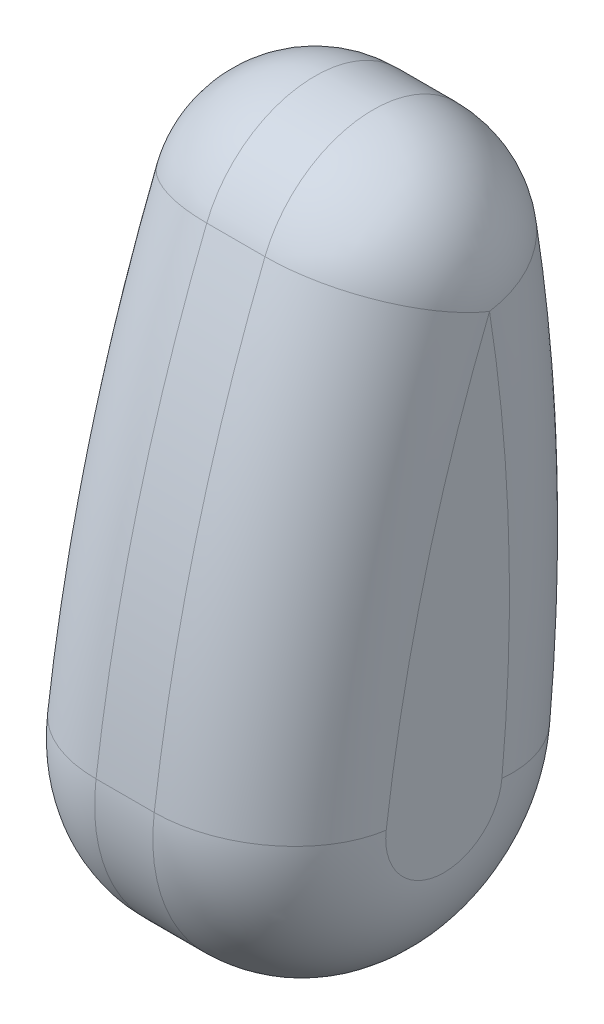
ISO-10303-21;
HEADER;
FILE_DESCRIPTION(('STEP AP214'),'2;1');
FILE_NAME('part.step','',(''),(''),'','','');
FILE_SCHEMA(('AUTOMOTIVE_DESIGN { 1 0 10303 214 1 1 1 1 }'));
ENDSEC;
DATA;
#1=APPLICATION_CONTEXT('core data for automotive mechanical design processes');
#2=APPLICATION_PROTOCOL_DEFINITION('international standard','automotive_design',2000,#1);
#3=PRODUCT_CONTEXT('',#1,'mechanical');
#4=PRODUCT('Part','Part','',(#3));
#5=PRODUCT_RELATED_PRODUCT_CATEGORY('part','',(#4));
#6=PRODUCT_DEFINITION_FORMATION('','',#4);
#7=PRODUCT_DEFINITION_CONTEXT('part definition',#1,'design');
#8=PRODUCT_DEFINITION('design','',#6,#7);
#9=PRODUCT_DEFINITION_SHAPE('','',#8);
#10=(LENGTH_UNIT() NAMED_UNIT(*) SI_UNIT(.MILLI.,.METRE.));
#11=(NAMED_UNIT(*) PLANE_ANGLE_UNIT() SI_UNIT($,.RADIAN.));
#12=(NAMED_UNIT(*) SI_UNIT($,.STERADIAN.) SOLID_ANGLE_UNIT());
#13=UNCERTAINTY_MEASURE_WITH_UNIT(LENGTH_MEASURE(1.E-05),#10,'distance_accuracy_value','');
#14=(GEOMETRIC_REPRESENTATION_CONTEXT(3) GLOBAL_UNCERTAINTY_ASSIGNED_CONTEXT((#13)) GLOBAL_UNIT_ASSIGNED_CONTEXT((#10,
#11,#12)) REPRESENTATION_CONTEXT('',''));
#15=CARTESIAN_POINT('',(0.,0.,0.));
#16=DIRECTION('',(0.,0.,1.));
#17=DIRECTION('',(1.,0.,0.));
#18=AXIS2_PLACEMENT_3D('',#15,#16,#17);
#19=CARTESIAN_POINT('',(-12.7000000000001,258.624713958398,676.690201839394));
#20=DIRECTION('',(-1.,0.,0.));
#21=DIRECTION('',(0.,0.,1.));
#22=AXIS2_PLACEMENT_3D('',#19,#20,#21);
#23=TOROIDAL_SURFACE('',#22,711.2,50.8);
#24=CARTESIAN_POINT('',(-12.6999999999948,190.320624404613,-31.222216013433));
#25=DIRECTION('',(1.70149166636778E-13,0.995377415428558,-0.0960406208578616));
#26=DIRECTION('',(0.,-0.0960406208578616,-0.995377415428558));
#27=AXIS2_PLACEMENT_3D('',#24,#25,#26);
#28=CIRCLE('',#27,50.7999999999998);
#29=CARTESIAN_POINT('',(-63.4999999999979,190.320624404621,-31.2222160134343));
#30=VERTEX_POINT('',#29);
#31=CARTESIAN_POINT('',(-12.7,185.441760865058,-81.7873887172027));
#32=VERTEX_POINT('',#31);
#33=EDGE_CURVE('E82',#30,#32,#28,.F.);
#34=ORIENTED_EDGE('',*,*,#33,.F.);
#35=CARTESIAN_POINT('',(-63.5,258.624713958398,676.690201839394));
#36=DIRECTION('',(-1.,0.,0.));
#37=DIRECTION('',(0.,0.,1.));
#38=AXIS2_PLACEMENT_3D('',#35,#36,#37);
#39=CIRCLE('',#38,711.2);
#40=CARTESIAN_POINT('',(-63.5,369.444816208991,-25.8226770013918));
#41=VERTEX_POINT('',#40);
#42=EDGE_CURVE('E86',#41,#30,#39,.T.);
#43=ORIENTED_EDGE('',*,*,#42,.F.);
#44=CARTESIAN_POINT('',(-12.7,369.444816208991,-25.8226770013919));
#45=DIRECTION('',(0.,0.987785262712015,0.155821291128508));
#46=DIRECTION('',(0.,-0.155821291128508,0.987785262712015));
#47=AXIS2_PLACEMENT_3D('',#44,#45,#46);
#48=CIRCLE('',#47,50.8);
#49=CARTESIAN_POINT('',(-12.7,377.36053779832,-76.0021683471621));
#50=VERTEX_POINT('',#49);
#51=EDGE_CURVE('E106',#50,#41,#48,.T.);
#52=ORIENTED_EDGE('',*,*,#51,.F.);
#53=CARTESIAN_POINT('',(-12.7,258.624713958398,676.690201839394));
#54=DIRECTION('',(-1.,0.,0.));
#55=DIRECTION('',(0.,0.,1.));
#56=AXIS2_PLACEMENT_3D('',#53,#54,#55);
#57=CIRCLE('',#56,762.);
#58=EDGE_CURVE('E89',#32,#50,#57,.F.);
#59=ORIENTED_EDGE('',*,*,#58,.F.);
#60=EDGE_LOOP('',(#34,#43,#52,#59));
#61=FACE_BOUND('',#60,.T.);
#62=ADVANCED_FACE('F16',(#61),#23,.T.);
#63=CARTESIAN_POINT('',(63.5,258.624713958398,676.690201839394));
#64=DIRECTION('',(-1.,0.,0.));
#65=DIRECTION('',(0.,0.,1.));
#66=AXIS2_PLACEMENT_3D('',#63,#64,#65);
#67=CYLINDRICAL_SURFACE('',#66,762.);
#68=DIRECTION('',(-1.,0.,0.));
#69=VECTOR('',#68,1.);
#70=CARTESIAN_POINT('',(63.5,377.36053779832,-76.0021683471621));
#71=LINE('',#70,#69);
#72=CARTESIAN_POINT('',(12.7,377.36053779832,-76.0021683471621));
#73=VERTEX_POINT('',#72);
#74=EDGE_CURVE('E183',#73,#50,#71,.T.);
#75=ORIENTED_EDGE('',*,*,#74,.F.);
#76=CARTESIAN_POINT('',(12.6999999999997,258.624713958398,676.690201839393));
#77=DIRECTION('',(1.,0.,0.));
#78=DIRECTION('',(0.,0.,-1.));
#79=AXIS2_PLACEMENT_3D('',#76,#77,#78);
#80=CIRCLE('',#79,761.999999999999);
#81=CARTESIAN_POINT('',(12.7000000000038,185.441760865066,-81.7873887172034));
#82=VERTEX_POINT('',#81);
#83=EDGE_CURVE('E193',#82,#73,#80,.T.);
#84=ORIENTED_EDGE('',*,*,#83,.F.);
#85=DIRECTION('',(-1.,0.,0.));
#86=VECTOR('',#85,1.);
#87=CARTESIAN_POINT('',(63.5,185.441760865066,-81.7873887172023));
#88=LINE('',#87,#86);
#89=EDGE_CURVE('E199',#32,#82,#88,.F.);
#90=ORIENTED_EDGE('',*,*,#89,.F.);
#91=ORIENTED_EDGE('',*,*,#58,.T.);
#92=EDGE_LOOP('',(#75,#84,#90,#91));
#93=FACE_BOUND('',#92,.T.);
#94=ADVANCED_FACE('F272',(#93),#67,.T.);
#95=CARTESIAN_POINT('',(-12.6999999999999,369.444816208991,-25.8226770013918));
#96=DIRECTION('',(1.,0.,0.));
#97=DIRECTION('',(0.,1.,0.));
#98=AXIS2_PLACEMENT_3D('',#95,#96,#97);
#99=SPHERICAL_SURFACE('',#98,50.8000000000001);
#100=CARTESIAN_POINT('',(-12.7,369.444816208991,-25.8226770013918));
#101=DIRECTION('',(-1.,0.,0.));
#102=DIRECTION('',(0.,0.,1.));
#103=AXIS2_PLACEMENT_3D('',#100,#101,#102);
#104=CIRCLE('',#103,50.7999999999999);
#105=CARTESIAN_POINT('',(-12.7,388.315122380009,21.3424748059754));
#106=VERTEX_POINT('',#105);
#107=EDGE_CURVE('E175',#50,#106,#104,.F.);
#108=ORIENTED_EDGE('',*,*,#107,.F.);
#109=ORIENTED_EDGE('',*,*,#51,.T.);
#110=CARTESIAN_POINT('',(-12.7,369.444816208991,-25.822677001392));
#111=DIRECTION('',(0.,-0.928447870223772,0.371462719901934));
#112=DIRECTION('',(0.,-0.371462719901934,-0.928447870223772));
#113=AXIS2_PLACEMENT_3D('',#110,#111,#112);
#114=CIRCLE('',#113,50.8);
#115=EDGE_CURVE('E173',#106,#41,#114,.T.);
#116=ORIENTED_EDGE('',*,*,#115,.F.);
#117=EDGE_LOOP('',(#108,#109,#116));
#118=FACE_BOUND('',#117,.T.);
#119=ADVANCED_FACE('F245',(#118),#99,.T.);
#120=CARTESIAN_POINT('',(-63.5,157.286657085043,-37.1547824372344));
#121=DIRECTION('',(-1.,0.,0.));
#122=DIRECTION('',(0.,0.,1.));
#123=AXIS2_PLACEMENT_3D('',#120,#121,#122);
#124=PLANE('',#123);
#125=CARTESIAN_POINT('',(-63.4999999999956,192.760056174411,-5.93962966154688));
#126=DIRECTION('',(1.,-1.65709346215678E-13,0.));
#127=DIRECTION('',(0.,0.127587527499766,0.991827315023385));
#128=AXIS2_PLACEMENT_3D('',#125,#126,#127);
#129=CIRCLE('',#128,25.4000000000026);
#130=CARTESIAN_POINT('',(-63.4999999999993,196.000779372906,19.2527841400497));
#131=VERTEX_POINT('',#130);
#132=CARTESIAN_POINT('',(-63.4999999999999,167.360056174403,-5.9396296615455));
#133=VERTEX_POINT('',#132);
#134=EDGE_CURVE('E97',#131,#133,#129,.T.);
#135=ORIENTED_EDGE('',*,*,#134,.F.);
#136=CARTESIAN_POINT('',(-63.5,105.260529814736,-686.134802304539));
#137=DIRECTION('',(-1.,0.,0.));
#138=DIRECTION('',(0.,0.,1.));
#139=AXIS2_PLACEMENT_3D('',#136,#137,#138);
#140=CIRCLE('',#139,711.2);
#141=EDGE_CURVE('E104',#41,#131,#140,.F.);
#142=ORIENTED_EDGE('',*,*,#141,.F.);
#143=ORIENTED_EDGE('',*,*,#42,.T.);
#144=CARTESIAN_POINT('',(-63.4999999999956,192.760056174411,-5.93962966154688));
#145=DIRECTION('',(1.,-1.65709346215678E-13,0.));
#146=DIRECTION('',(-1.66096358014711E-13,-1.,0.));
#147=AXIS2_PLACEMENT_3D('',#144,#145,#146);
#148=CIRCLE('',#147,25.4000000000116);
#149=EDGE_CURVE('E94',#30,#133,#148,.F.);
#150=ORIENTED_EDGE('',*,*,#149,.T.);
#151=EDGE_LOOP('',(#135,#142,#143,#150));
#152=FACE_BOUND('',#151,.T.);
#153=ADVANCED_FACE('F102',(#152),#124,.T.);
#154=CARTESIAN_POINT('',(-12.6999999999916,218.160056174406,-5.93962966154413));
#155=DIRECTION('',(0.,0.,1.));
#156=DIRECTION('',(1.65720728915659E-13,1.,0.));
#157=AXIS2_PLACEMENT_3D('',#154,#155,#156);
#158=CIRCLE('',#157,50.7999999999998);
#159=TRIMMED_CURVE('',#158,(PARAMETER_VALUE(-2.09439510239328)),
(PARAMETER_VALUE(2.09439510239328)),.T.,.PARAMETER.);
#160=CARTESIAN_POINT('',(-12.6999999999958,192.760056174403,-5.93962966154413));
#161=DIRECTION('',(1.,-1.65709346215678E-13,0.));
#162=AXIS1_PLACEMENT('',#160,#161);
#163=SURFACE_OF_REVOLUTION('',#159,#162);
#164=CARTESIAN_POINT('',(-12.7,192.760056174399,-5.93962966154271));
#165=DIRECTION('',(-1.,0.,0.));
#166=DIRECTION('',(0.,0.,1.));
#167=AXIS2_PLACEMENT_3D('',#164,#165,#166);
#168=CIRCLE('',#167,76.2);
#169=CARTESIAN_POINT('',(-12.7,202.482225769918,69.6376117432342));
#170=VERTEX_POINT('',#169);
#171=EDGE_CURVE('E149',#170,#32,#168,.F.);
#172=ORIENTED_EDGE('',*,*,#171,.F.);
#173=CARTESIAN_POINT('',(-12.7,196.000779372906,19.2527841400497));
#174=DIRECTION('',(0.,0.991827315023324,-0.127587527500238));
#175=DIRECTION('',(0.,0.127587527500238,0.991827315023324));
#176=AXIS2_PLACEMENT_3D('',#173,#174,#175);
#177=CIRCLE('',#176,50.8);
#178=EDGE_CURVE('E162',#131,#170,#177,.T.);
#179=ORIENTED_EDGE('',*,*,#178,.F.);
#180=ORIENTED_EDGE('',*,*,#134,.T.);
#181=ORIENTED_EDGE('',*,*,#149,.F.);
#182=ORIENTED_EDGE('',*,*,#33,.T.);
#183=EDGE_LOOP('',(#172,#179,#180,#181,#182));
#184=FACE_BOUND('',#183,.T.);
#185=ADVANCED_FACE('F95',(#184),#163,.F.);
#186=CARTESIAN_POINT('',(12.6999999999997,258.624713958398,676.690201839393));
#187=DIRECTION('',(-1.,0.,0.));
#188=DIRECTION('',(0.,0.,1.));
#189=AXIS2_PLACEMENT_3D('',#186,#187,#188);
#190=TOROIDAL_SURFACE('',#189,711.199999999999,50.8);
#191=CARTESIAN_POINT('',(12.7,369.444816208991,-25.8226770013918));
#192=DIRECTION('',(0.,0.987785262712015,0.155821291128508));
#193=DIRECTION('',(0.,-0.155821291128508,0.987785262712015));
#194=AXIS2_PLACEMENT_3D('',#191,#192,#193);
#195=CIRCLE('',#194,50.8);
#196=CARTESIAN_POINT('',(63.4999999999999,369.444816208991,-25.8226770013919));
#197=VERTEX_POINT('',#196);
#198=EDGE_CURVE('E190',#197,#73,#195,.T.);
#199=ORIENTED_EDGE('',*,*,#198,.F.);
#200=CARTESIAN_POINT('',(63.4999999999997,258.624713958398,676.690201839393));
#201=DIRECTION('',(-1.,0.,0.));
#202=DIRECTION('',(0.,0.,1.));
#203=AXIS2_PLACEMENT_3D('',#200,#201,#202);
#204=CIRCLE('',#203,711.199999999999);
#205=CARTESIAN_POINT('',(63.500000000001,190.32062440462,-31.2222160134294));
#206=VERTEX_POINT('',#205);
#207=EDGE_CURVE('E187',#206,#197,#204,.F.);
#208=ORIENTED_EDGE('',*,*,#207,.F.);
#209=CARTESIAN_POINT('',(12.7,190.320624404622,-31.2222160134292));
#210=DIRECTION('',(0.,0.995377415428604,-0.0960406208573878));
#211=DIRECTION('',(0.,0.0960406208573878,0.995377415428604));
#212=AXIS2_PLACEMENT_3D('',#209,#210,#211);
#213=CIRCLE('',#212,50.8);
#214=EDGE_CURVE('E196',#206,#82,#213,.T.);
#215=ORIENTED_EDGE('',*,*,#214,.T.);
#216=ORIENTED_EDGE('',*,*,#83,.T.);
#217=EDGE_LOOP('',(#199,#208,#215,#216));
#218=FACE_BOUND('',#217,.T.);
#219=ADVANCED_FACE('F217',(#218),#190,.T.);
#220=CARTESIAN_POINT('',(63.5,369.444816208991,-25.8226770013918));
#221=DIRECTION('',(-1.,0.,0.));
#222=DIRECTION('',(0.,0.,1.));
#223=AXIS2_PLACEMENT_3D('',#220,#221,#222);
#224=CYLINDRICAL_SURFACE('',#223,50.7999999999999);
#225=CARTESIAN_POINT('',(12.7,369.444816208991,-25.8226770013918));
#226=DIRECTION('',(1.,0.,0.));
#227=DIRECTION('',(0.,1.,0.));
#228=AXIS2_PLACEMENT_3D('',#225,#226,#227);
#229=CIRCLE('',#228,50.8);
#230=CARTESIAN_POINT('',(12.7,388.31512238001,21.3424748059756));
#231=VERTEX_POINT('',#230);
#232=EDGE_CURVE('E179',#73,#231,#229,.T.);
#233=ORIENTED_EDGE('',*,*,#232,.F.);
#234=ORIENTED_EDGE('',*,*,#74,.T.);
#235=ORIENTED_EDGE('',*,*,#107,.T.);
#236=DIRECTION('',(-1.,0.,0.));
#237=VECTOR('',#236,1.);
#238=CARTESIAN_POINT('',(63.5,388.315122380009,21.3424748059752));
#239=LINE('',#238,#237);
#240=EDGE_CURVE('E37',#231,#106,#239,.T.);
#241=ORIENTED_EDGE('',*,*,#240,.F.);
#242=EDGE_LOOP('',(#233,#234,#235,#241));
#243=FACE_BOUND('',#242,.T.);
#244=ADVANCED_FACE('F218',(#243),#224,.T.);
#245=CARTESIAN_POINT('',(-12.7,105.260529814736,-686.134802304539));
#246=DIRECTION('',(-1.,0.,0.));
#247=DIRECTION('',(0.,0.,1.));
#248=AXIS2_PLACEMENT_3D('',#245,#246,#247);
#249=TOROIDAL_SURFACE('',#248,711.2,50.8);
#250=ORIENTED_EDGE('',*,*,#178,.T.);
#251=CARTESIAN_POINT('',(-12.7,105.260529814736,-686.134802304539));
#252=DIRECTION('',(-1.,0.,0.));
#253=DIRECTION('',(0.,0.,1.));
#254=AXIS2_PLACEMENT_3D('',#251,#252,#253);
#255=CIRCLE('',#254,762.);
#256=EDGE_CURVE('E156',#106,#170,#255,.F.);
#257=ORIENTED_EDGE('',*,*,#256,.F.);
#258=ORIENTED_EDGE('',*,*,#115,.T.);
#259=ORIENTED_EDGE('',*,*,#141,.T.);
#260=EDGE_LOOP('',(#250,#257,#258,#259));
#261=FACE_BOUND('',#260,.T.);
#262=ADVANCED_FACE('F241',(#261),#249,.T.);
#263=CARTESIAN_POINT('',(63.5,192.760056174399,-5.93962966154271));
#264=DIRECTION('',(-1.,0.,0.));
#265=DIRECTION('',(0.,0.,1.));
#266=AXIS2_PLACEMENT_3D('',#263,#264,#265);
#267=CYLINDRICAL_SURFACE('',#266,76.2);
#268=DIRECTION('',(-1.,0.,0.));
#269=VECTOR('',#268,1.);
#270=CARTESIAN_POINT('',(63.5,202.482225769918,69.6376117432339));
#271=LINE('',#270,#269);
#272=CARTESIAN_POINT('',(12.7,202.482225769918,69.637611743235));
#273=VERTEX_POINT('',#272);
#274=EDGE_CURVE('E152',#170,#273,#271,.F.);
#275=ORIENTED_EDGE('',*,*,#274,.F.);
#276=ORIENTED_EDGE('',*,*,#171,.T.);
#277=ORIENTED_EDGE('',*,*,#89,.T.);
#278=CARTESIAN_POINT('',(12.7000000000024,192.760056174403,-5.93962966154407));
#279=DIRECTION('',(1.,-1.61179031626177E-13,0.));
#280=DIRECTION('',(1.61179031626185E-13,1.,0.));
#281=AXIS2_PLACEMENT_3D('',#278,#279,#280);
#282=CIRCLE('',#281,76.2000000000033);
#283=EDGE_CURVE('E146',#273,#82,#282,.T.);
#284=ORIENTED_EDGE('',*,*,#283,.F.);
#285=EDGE_LOOP('',(#275,#276,#277,#284));
#286=FACE_BOUND('',#285,.T.);
#287=ADVANCED_FACE('F135',(#286),#267,.T.);
#288=CARTESIAN_POINT('',(12.7000000000083,218.160056174406,-5.93962966154407));
#289=DIRECTION('',(0.,0.,1.));
#290=DIRECTION('',(1.61179031626192E-13,1.,0.));
#291=AXIS2_PLACEMENT_3D('',#288,#289,#290);
#292=CIRCLE('',#291,50.7999999999998);
#293=TRIMMED_CURVE('',#292,(PARAMETER_VALUE(-2.09439510239328)),
(PARAMETER_VALUE(2.09439510239328)),.T.,.PARAMETER.);
#294=CARTESIAN_POINT('',(12.7000000000042,192.760056174403,-5.93962966154407));
#295=DIRECTION('',(1.,-1.61179031626177E-13,0.));
#296=AXIS1_PLACEMENT('',#294,#295);
#297=SURFACE_OF_REVOLUTION('',#293,#296);
#298=CARTESIAN_POINT('',(12.7,196.000779372906,19.2527841400497));
#299=DIRECTION('',(0.,0.991827315023324,-0.127587527500238));
#300=DIRECTION('',(0.,0.127587527500238,0.991827315023324));
#301=AXIS2_PLACEMENT_3D('',#298,#299,#300);
#302=CIRCLE('',#301,50.8);
#303=CARTESIAN_POINT('',(63.5000000000006,196.000779372905,19.2527841400488));
#304=VERTEX_POINT('',#303);
#305=EDGE_CURVE('E155',#273,#304,#302,.T.);
#306=ORIENTED_EDGE('',*,*,#305,.F.);
#307=ORIENTED_EDGE('',*,*,#283,.T.);
#308=ORIENTED_EDGE('',*,*,#214,.F.);
#309=CARTESIAN_POINT('',(63.500000000004,192.760056174394,-5.93962966154144));
#310=DIRECTION('',(-1.,1.61179031626177E-13,0.));
#311=DIRECTION('',(0.,-0.0960406208574333,-0.995377415428599));
#312=AXIS2_PLACEMENT_3D('',#309,#310,#311);
#313=CIRCLE('',#312,25.4000000000021);
#314=CARTESIAN_POINT('',(63.4999999999999,167.360056174397,-5.93962966154222));
#315=VERTEX_POINT('',#314);
#316=EDGE_CURVE('E118',#315,#206,#313,.F.);
#317=ORIENTED_EDGE('',*,*,#316,.F.);
#318=CARTESIAN_POINT('',(63.500000000004,192.760056174394,-5.93962966154144));
#319=DIRECTION('',(-1.,1.61179031626177E-13,0.));
#320=DIRECTION('',(-1.61179031626224E-13,-1.,0.));
#321=AXIS2_PLACEMENT_3D('',#318,#319,#320);
#322=CIRCLE('',#321,25.399999999995);
#323=EDGE_CURVE('E148',#304,#315,#322,.F.);
#324=ORIENTED_EDGE('',*,*,#323,.F.);
#325=EDGE_LOOP('',(#306,#307,#308,#317,#324));
#326=FACE_BOUND('',#325,.T.);
#327=ADVANCED_FACE('F123',(#326),#297,.F.);
#328=CARTESIAN_POINT('',(63.5,157.286657085043,-37.1547824372344));
#329=DIRECTION('',(1.,0.,0.));
#330=DIRECTION('',(0.,0.,-1.));
#331=AXIS2_PLACEMENT_3D('',#328,#329,#330);
#332=PLANE('',#331);
#333=ORIENTED_EDGE('',*,*,#207,.T.);
#334=CARTESIAN_POINT('',(63.4999999999997,105.260529814737,-686.134802304536));
#335=DIRECTION('',(-1.,0.,0.));
#336=DIRECTION('',(0.,0.,1.));
#337=AXIS2_PLACEMENT_3D('',#334,#335,#336);
#338=CIRCLE('',#337,711.199999999997);
#339=EDGE_CURVE('E227',#304,#197,#338,.T.);
#340=ORIENTED_EDGE('',*,*,#339,.F.);
#341=ORIENTED_EDGE('',*,*,#323,.T.);
#342=ORIENTED_EDGE('',*,*,#316,.T.);
#343=EDGE_LOOP('',(#333,#340,#341,#342));
#344=FACE_BOUND('',#343,.T.);
#345=ADVANCED_FACE('F134',(#344),#332,.T.);
#346=CARTESIAN_POINT('',(12.6999999999999,369.444816208991,-25.8226770013918));
#347=DIRECTION('',(1.,0.,0.));
#348=DIRECTION('',(0.,1.,0.));
#349=AXIS2_PLACEMENT_3D('',#346,#347,#348);
#350=SPHERICAL_SURFACE('',#349,50.8);
#351=CARTESIAN_POINT('',(12.7,369.444816208991,-25.8226770013919));
#352=DIRECTION('',(0.,-0.928447870223772,0.371462719901934));
#353=DIRECTION('',(0.,-0.371462719901934,-0.928447870223772));
#354=AXIS2_PLACEMENT_3D('',#351,#352,#353);
#355=CIRCLE('',#354,50.8);
#356=EDGE_CURVE('E28',#197,#231,#355,.T.);
#357=ORIENTED_EDGE('',*,*,#356,.F.);
#358=ORIENTED_EDGE('',*,*,#198,.T.);
#359=ORIENTED_EDGE('',*,*,#232,.T.);
#360=EDGE_LOOP('',(#357,#358,#359));
#361=FACE_BOUND('',#360,.T.);
#362=ADVANCED_FACE('F306',(#361),#350,.T.);
#363=CARTESIAN_POINT('',(63.5,105.260529814736,-686.134802304539));
#364=DIRECTION('',(-1.,0.,0.));
#365=DIRECTION('',(0.,0.,1.));
#366=AXIS2_PLACEMENT_3D('',#363,#364,#365);
#367=CYLINDRICAL_SURFACE('',#366,762.);
#368=ORIENTED_EDGE('',*,*,#274,.T.);
#369=CARTESIAN_POINT('',(12.6999999999997,105.260529814737,-686.134802304536));
#370=DIRECTION('',(1.,0.,0.));
#371=DIRECTION('',(0.,0.,-1.));
#372=AXIS2_PLACEMENT_3D('',#369,#370,#371);
#373=CIRCLE('',#372,761.999999999997);
#374=EDGE_CURVE('E11',#231,#273,#373,.T.);
#375=ORIENTED_EDGE('',*,*,#374,.F.);
#376=ORIENTED_EDGE('',*,*,#240,.T.);
#377=ORIENTED_EDGE('',*,*,#256,.T.);
#378=EDGE_LOOP('',(#368,#375,#376,#377));
#379=FACE_BOUND('',#378,.T.);
#380=ADVANCED_FACE('F280',(#379),#367,.T.);
#381=CARTESIAN_POINT('',(12.6999999999997,105.260529814737,-686.134802304536));
#382=DIRECTION('',(-1.,0.,0.));
#383=DIRECTION('',(0.,0.,1.));
#384=AXIS2_PLACEMENT_3D('',#381,#382,#383);
#385=TOROIDAL_SURFACE('',#384,711.199999999997,50.8);
#386=ORIENTED_EDGE('',*,*,#356,.T.);
#387=ORIENTED_EDGE('',*,*,#374,.T.);
#388=ORIENTED_EDGE('',*,*,#305,.T.);
#389=ORIENTED_EDGE('',*,*,#339,.T.);
#390=EDGE_LOOP('',(#386,#387,#388,#389));
#391=FACE_BOUND('',#390,.T.);
#392=ADVANCED_FACE('F18',(#391),#385,.T.);
#393=CLOSED_SHELL('',(#62,#94,#119,#153,#185,#219,#244,#262,#287,#327,#345,#362,#380,#392));
#394=MANIFOLD_SOLID_BREP('B1',#393);
#395=ADVANCED_BREP_SHAPE_REPRESENTATION('',(#18,#394),#14);
#396=SHAPE_DEFINITION_REPRESENTATION(#9,#395);
ENDSEC;
END-ISO-10303-21;
